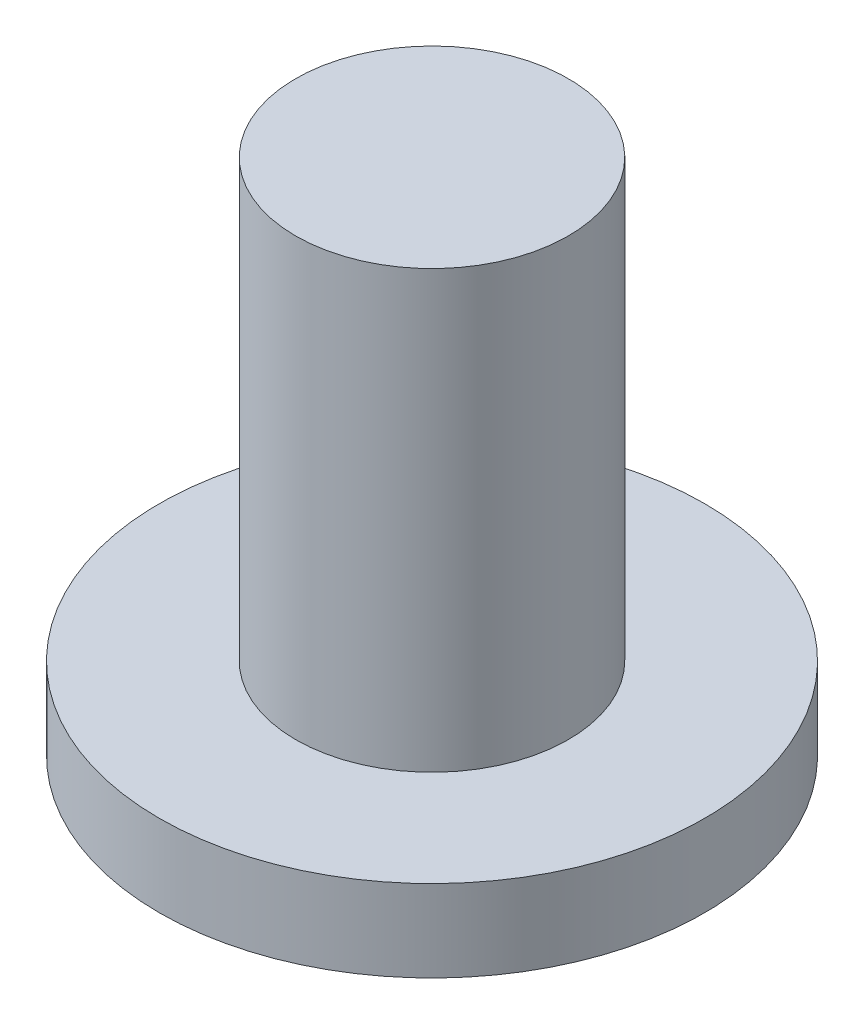
ISO-10303-21;
HEADER;
FILE_DESCRIPTION(('STEP AP214'),'2;1');
FILE_NAME('part.step','',(''),(''),'','','');
FILE_SCHEMA(('AUTOMOTIVE_DESIGN { 1 0 10303 214 1 1 1 1 }'));
ENDSEC;
DATA;
#1=APPLICATION_CONTEXT('core data for automotive mechanical design processes');
#2=APPLICATION_PROTOCOL_DEFINITION('international standard','automotive_design',2000,#1);
#3=PRODUCT_CONTEXT('',#1,'mechanical');
#4=PRODUCT('Part','Part','',(#3));
#5=PRODUCT_RELATED_PRODUCT_CATEGORY('part','',(#4));
#6=PRODUCT_DEFINITION_FORMATION('','',#4);
#7=PRODUCT_DEFINITION_CONTEXT('part definition',#1,'design');
#8=PRODUCT_DEFINITION('design','',#6,#7);
#9=PRODUCT_DEFINITION_SHAPE('','',#8);
#10=(LENGTH_UNIT() NAMED_UNIT(*) SI_UNIT(.MILLI.,.METRE.));
#11=(NAMED_UNIT(*) PLANE_ANGLE_UNIT() SI_UNIT($,.RADIAN.));
#12=(NAMED_UNIT(*) SI_UNIT($,.STERADIAN.) SOLID_ANGLE_UNIT());
#13=UNCERTAINTY_MEASURE_WITH_UNIT(LENGTH_MEASURE(1.E-05),#10,'distance_accuracy_value','');
#14=(GEOMETRIC_REPRESENTATION_CONTEXT(3) GLOBAL_UNCERTAINTY_ASSIGNED_CONTEXT((#13)) GLOBAL_UNIT_ASSIGNED_CONTEXT((#10,
#11,#12)) REPRESENTATION_CONTEXT('',''));
#15=CARTESIAN_POINT('',(0.,0.,0.));
#16=DIRECTION('',(0.,0.,1.));
#17=DIRECTION('',(1.,0.,0.));
#18=AXIS2_PLACEMENT_3D('',#15,#16,#17);
#19=CARTESIAN_POINT('',(0.,3.,0.));
#20=DIRECTION('',(0.,-1.,0.));
#21=DIRECTION('',(0.,0.,-1.));
#22=AXIS2_PLACEMENT_3D('',#19,#20,#21);
#23=CYLINDRICAL_SURFACE('',#22,10.);
#24=CARTESIAN_POINT('',(0.,3.,0.));
#25=DIRECTION('',(0.,1.,0.));
#26=DIRECTION('',(0.,0.,1.));
#27=AXIS2_PLACEMENT_3D('',#24,#25,#26);
#28=CIRCLE('',#27,10.);
#29=CARTESIAN_POINT('',(0.,3.,10.));
#30=VERTEX_POINT('',#29);
#31=EDGE_CURVE('E38',#30,#30,#28,.T.);
#32=ORIENTED_EDGE('',*,*,#31,.F.);
#33=EDGE_LOOP('',(#32));
#34=FACE_BOUND('',#33,.T.);
#35=CARTESIAN_POINT('',(0.,0.,0.));
#36=DIRECTION('',(0.,1.,0.));
#37=DIRECTION('',(0.,0.,1.));
#38=AXIS2_PLACEMENT_3D('',#35,#36,#37);
#39=CIRCLE('',#38,10.);
#40=CARTESIAN_POINT('',(0.,0.,10.));
#41=VERTEX_POINT('',#40);
#42=EDGE_CURVE('E34',#41,#41,#39,.T.);
#43=ORIENTED_EDGE('',*,*,#42,.T.);
#44=EDGE_LOOP('',(#43));
#45=FACE_BOUND('',#44,.T.);
#46=ADVANCED_FACE('F31',(#34,#45),#23,.T.);
#47=CARTESIAN_POINT('',(0.,3.,0.));
#48=DIRECTION('',(0.,1.,0.));
#49=DIRECTION('',(0.,0.,1.));
#50=AXIS2_PLACEMENT_3D('',#47,#48,#49);
#51=PLANE('',#50);
#52=CARTESIAN_POINT('',(0.,3.,0.));
#53=DIRECTION('',(0.,1.,0.));
#54=DIRECTION('',(0.,0.,1.));
#55=AXIS2_PLACEMENT_3D('',#52,#53,#54);
#56=CIRCLE('',#55,5.);
#57=CARTESIAN_POINT('',(0.,3.,5.));
#58=VERTEX_POINT('',#57);
#59=EDGE_CURVE('E10',#58,#58,#56,.T.);
#60=ORIENTED_EDGE('',*,*,#59,.F.);
#61=EDGE_LOOP('',(#60));
#62=FACE_BOUND('',#61,.T.);
#63=ORIENTED_EDGE('',*,*,#31,.T.);
#64=EDGE_LOOP('',(#63));
#65=FACE_BOUND('',#64,.T.);
#66=ADVANCED_FACE('F55',(#62,#65),#51,.T.);
#67=CARTESIAN_POINT('',(0.,0.,0.));
#68=DIRECTION('',(0.,1.,0.));
#69=DIRECTION('',(0.,0.,1.));
#70=AXIS2_PLACEMENT_3D('',#67,#68,#69);
#71=PLANE('',#70);
#72=ORIENTED_EDGE('',*,*,#42,.F.);
#73=EDGE_LOOP('',(#72));
#74=FACE_BOUND('',#73,.T.);
#75=ADVANCED_FACE('F52',(#74),#71,.F.);
#76=CARTESIAN_POINT('',(0.,19.,0.));
#77=DIRECTION('',(0.,-1.,0.));
#78=DIRECTION('',(0.,0.,-1.));
#79=AXIS2_PLACEMENT_3D('',#76,#77,#78);
#80=CYLINDRICAL_SURFACE('',#79,5.);
#81=CARTESIAN_POINT('',(0.,19.,0.));
#82=DIRECTION('',(0.,1.,0.));
#83=DIRECTION('',(0.,0.,1.));
#84=AXIS2_PLACEMENT_3D('',#81,#82,#83);
#85=CIRCLE('',#84,5.);
#86=CARTESIAN_POINT('',(0.,19.,5.));
#87=VERTEX_POINT('',#86);
#88=EDGE_CURVE('E44',#87,#87,#85,.T.);
#89=ORIENTED_EDGE('',*,*,#88,.F.);
#90=EDGE_LOOP('',(#89));
#91=FACE_BOUND('',#90,.T.);
#92=ORIENTED_EDGE('',*,*,#59,.T.);
#93=EDGE_LOOP('',(#92));
#94=FACE_BOUND('',#93,.T.);
#95=ADVANCED_FACE('F54',(#91,#94),#80,.T.);
#96=CARTESIAN_POINT('',(0.,19.,0.));
#97=DIRECTION('',(0.,1.,0.));
#98=DIRECTION('',(0.,0.,1.));
#99=AXIS2_PLACEMENT_3D('',#96,#97,#98);
#100=PLANE('',#99);
#101=ORIENTED_EDGE('',*,*,#88,.T.);
#102=EDGE_LOOP('',(#101));
#103=FACE_BOUND('',#102,.T.);
#104=ADVANCED_FACE('F60',(#103),#100,.T.);
#105=CLOSED_SHELL('',(#46,#66,#75,#95,#104));
#106=MANIFOLD_SOLID_BREP('B2',#105);
#107=ADVANCED_BREP_SHAPE_REPRESENTATION('',(#18,#106),#14);
#108=SHAPE_DEFINITION_REPRESENTATION(#9,#107);
ENDSEC;
END-ISO-10303-21;
